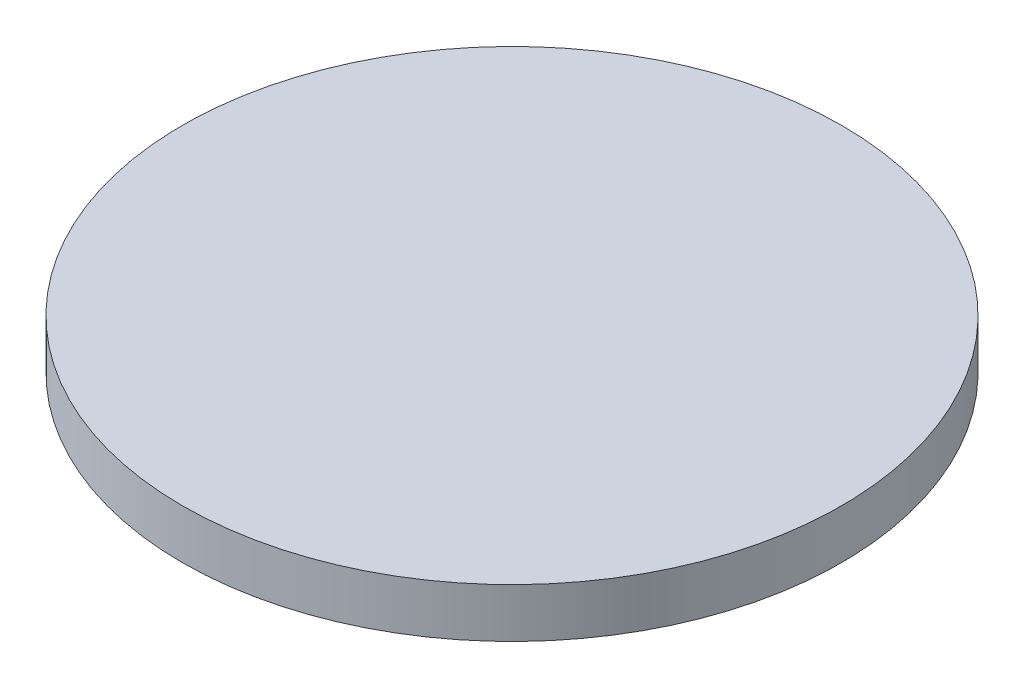
ISO-10303-21;
HEADER;
FILE_DESCRIPTION(('STEP AP214'),'2;1');
FILE_NAME('part.step','',(''),(''),'','','');
FILE_SCHEMA(('AUTOMOTIVE_DESIGN { 1 0 10303 214 1 1 1 1 }'));
ENDSEC;
DATA;
#1=APPLICATION_CONTEXT('core data for automotive mechanical design processes');
#2=APPLICATION_PROTOCOL_DEFINITION('international standard','automotive_design',2000,#1);
#3=PRODUCT_CONTEXT('',#1,'mechanical');
#4=PRODUCT('Part','Part','',(#3));
#5=PRODUCT_RELATED_PRODUCT_CATEGORY('part','',(#4));
#6=PRODUCT_DEFINITION_FORMATION('','',#4);
#7=PRODUCT_DEFINITION_CONTEXT('part definition',#1,'design');
#8=PRODUCT_DEFINITION('design','',#6,#7);
#9=PRODUCT_DEFINITION_SHAPE('','',#8);
#10=(LENGTH_UNIT() NAMED_UNIT(*) SI_UNIT(.MILLI.,.METRE.));
#11=(NAMED_UNIT(*) PLANE_ANGLE_UNIT() SI_UNIT($,.RADIAN.));
#12=(NAMED_UNIT(*) SI_UNIT($,.STERADIAN.) SOLID_ANGLE_UNIT());
#13=UNCERTAINTY_MEASURE_WITH_UNIT(LENGTH_MEASURE(1.E-05),#10,'distance_accuracy_value','');
#14=(GEOMETRIC_REPRESENTATION_CONTEXT(3) GLOBAL_UNCERTAINTY_ASSIGNED_CONTEXT((#13)) GLOBAL_UNIT_ASSIGNED_CONTEXT((#10,
#11,#12)) REPRESENTATION_CONTEXT('',''));
#15=CARTESIAN_POINT('',(0.,0.,0.));
#16=DIRECTION('',(0.,0.,1.));
#17=DIRECTION('',(1.,0.,0.));
#18=AXIS2_PLACEMENT_3D('',#15,#16,#17);
#19=CARTESIAN_POINT('',(0.,3.03784,0.));
#20=DIRECTION('',(0.,-1.,0.));
#21=DIRECTION('',(0.,0.,-1.));
#22=AXIS2_PLACEMENT_3D('',#19,#20,#21);
#23=CYLINDRICAL_SURFACE('',#22,20.32);
#24=CARTESIAN_POINT('',(0.,3.03784,0.));
#25=DIRECTION('',(0.,1.,0.));
#26=DIRECTION('',(0.,0.,1.));
#27=AXIS2_PLACEMENT_3D('',#24,#25,#26);
#28=CIRCLE('',#27,20.32);
#29=CARTESIAN_POINT('',(0.,3.03784,20.32));
#30=VERTEX_POINT('',#29);
#31=EDGE_CURVE('E10',#30,#30,#28,.T.);
#32=ORIENTED_EDGE('',*,*,#31,.F.);
#33=EDGE_LOOP('',(#32));
#34=FACE_BOUND('',#33,.T.);
#35=CARTESIAN_POINT('',(0.,0.,0.));
#36=DIRECTION('',(0.,1.,0.));
#37=DIRECTION('',(0.,0.,1.));
#38=AXIS2_PLACEMENT_3D('',#35,#36,#37);
#39=CIRCLE('',#38,20.32);
#40=CARTESIAN_POINT('',(0.,0.,20.32));
#41=VERTEX_POINT('',#40);
#42=EDGE_CURVE('E38',#41,#41,#39,.T.);
#43=ORIENTED_EDGE('',*,*,#42,.T.);
#44=EDGE_LOOP('',(#43));
#45=FACE_BOUND('',#44,.T.);
#46=ADVANCED_FACE('F35',(#34,#45),#23,.T.);
#47=CARTESIAN_POINT('',(0.,3.03784,0.));
#48=DIRECTION('',(0.,1.,0.));
#49=DIRECTION('',(0.,0.,1.));
#50=AXIS2_PLACEMENT_3D('',#47,#48,#49);
#51=PLANE('',#50);
#52=ORIENTED_EDGE('',*,*,#31,.T.);
#53=EDGE_LOOP('',(#52));
#54=FACE_BOUND('',#53,.T.);
#55=ADVANCED_FACE('F50',(#54),#51,.T.);
#56=CARTESIAN_POINT('',(0.,0.,0.));
#57=DIRECTION('',(0.,1.,0.));
#58=DIRECTION('',(0.,0.,1.));
#59=AXIS2_PLACEMENT_3D('',#56,#57,#58);
#60=PLANE('',#59);
#61=ORIENTED_EDGE('',*,*,#42,.F.);
#62=EDGE_LOOP('',(#61));
#63=FACE_BOUND('',#62,.T.);
#64=ADVANCED_FACE('F48',(#63),#60,.F.);
#65=CLOSED_SHELL('',(#46,#55,#64));
#66=MANIFOLD_SOLID_BREP('B2',#65);
#67=ADVANCED_BREP_SHAPE_REPRESENTATION('',(#18,#66),#14);
#68=SHAPE_DEFINITION_REPRESENTATION(#9,#67);
ENDSEC;
END-ISO-10303-21;
